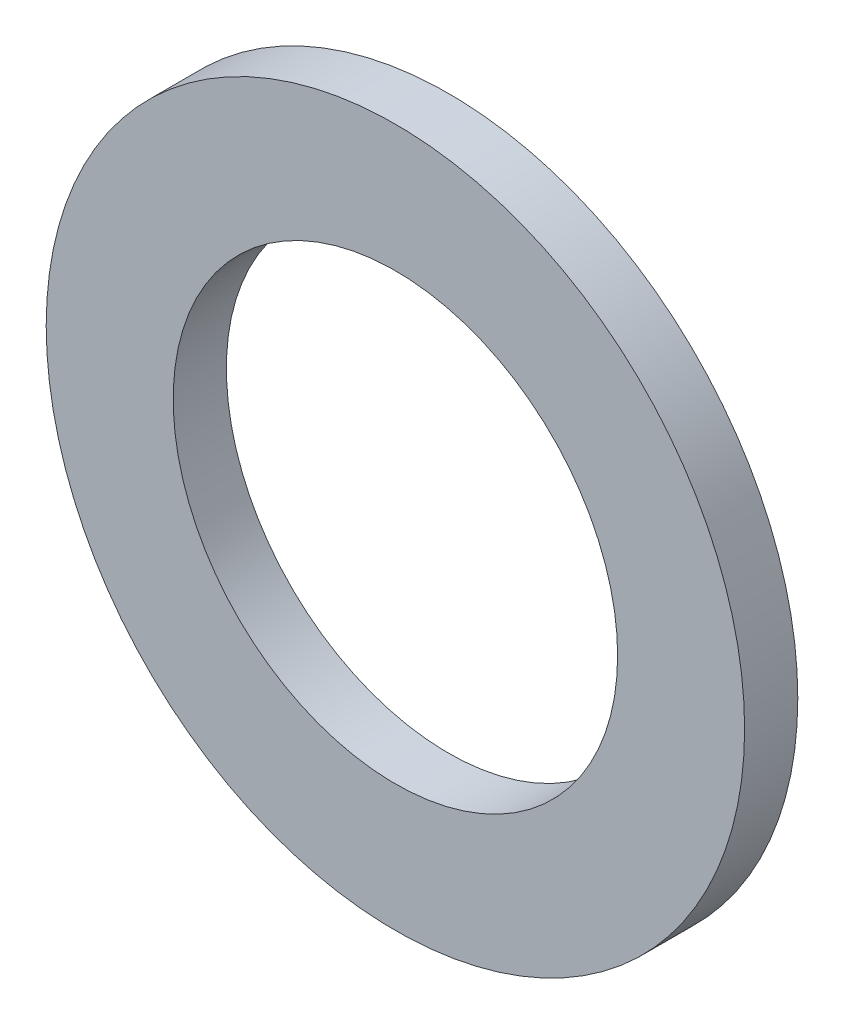
ISO-10303-21;
HEADER;
FILE_DESCRIPTION(('STEP AP214'),'2;1');
FILE_NAME('part.step','',(''),(''),'','','');
FILE_SCHEMA(('AUTOMOTIVE_DESIGN { 1 0 10303 214 1 1 1 1 }'));
ENDSEC;
DATA;
#1=APPLICATION_CONTEXT('core data for automotive mechanical design processes');
#2=APPLICATION_PROTOCOL_DEFINITION('international standard','automotive_design',2000,#1);
#3=PRODUCT_CONTEXT('',#1,'mechanical');
#4=PRODUCT('Part','Part','',(#3));
#5=PRODUCT_RELATED_PRODUCT_CATEGORY('part','',(#4));
#6=PRODUCT_DEFINITION_FORMATION('','',#4);
#7=PRODUCT_DEFINITION_CONTEXT('part definition',#1,'design');
#8=PRODUCT_DEFINITION('design','',#6,#7);
#9=PRODUCT_DEFINITION_SHAPE('','',#8);
#10=(LENGTH_UNIT() NAMED_UNIT(*) SI_UNIT(.MILLI.,.METRE.));
#11=(NAMED_UNIT(*) PLANE_ANGLE_UNIT() SI_UNIT($,.RADIAN.));
#12=(NAMED_UNIT(*) SI_UNIT($,.STERADIAN.) SOLID_ANGLE_UNIT());
#13=UNCERTAINTY_MEASURE_WITH_UNIT(LENGTH_MEASURE(1.E-05),#10,'distance_accuracy_value','');
#14=(GEOMETRIC_REPRESENTATION_CONTEXT(3) GLOBAL_UNCERTAINTY_ASSIGNED_CONTEXT((#13)) GLOBAL_UNIT_ASSIGNED_CONTEXT((#10,
#11,#12)) REPRESENTATION_CONTEXT('',''));
#15=CARTESIAN_POINT('',(0.,0.,0.));
#16=DIRECTION('',(0.,0.,1.));
#17=DIRECTION('',(1.,0.,0.));
#18=AXIS2_PLACEMENT_3D('',#15,#16,#17);
#19=CARTESIAN_POINT('',(0.,0.,3.35));
#20=DIRECTION('',(0.,0.,1.));
#21=DIRECTION('',(1.,0.,0.));
#22=AXIS2_PLACEMENT_3D('',#19,#20,#21);
#23=PLANE('',#22);
#24=CARTESIAN_POINT('',(0.,0.,3.35));
#25=DIRECTION('',(0.,0.,1.));
#26=DIRECTION('',(1.,0.,0.));
#27=AXIS2_PLACEMENT_3D('',#24,#25,#26);
#28=CIRCLE('',#27,22.);
#29=CARTESIAN_POINT('',(22.,0.,3.35));
#30=VERTEX_POINT('',#29);
#31=EDGE_CURVE('E11',#30,#30,#28,.T.);
#32=ORIENTED_EDGE('',*,*,#31,.T.);
#33=EDGE_LOOP('',(#32));
#34=FACE_BOUND('',#33,.T.);
#35=CARTESIAN_POINT('',(0.,0.,3.35));
#36=DIRECTION('',(0.,0.,1.));
#37=DIRECTION('',(1.,0.,0.));
#38=AXIS2_PLACEMENT_3D('',#35,#36,#37);
#39=CIRCLE('',#38,14.);
#40=CARTESIAN_POINT('',(14.,0.,3.35));
#41=VERTEX_POINT('',#40);
#42=EDGE_CURVE('E49',#41,#41,#39,.T.);
#43=ORIENTED_EDGE('',*,*,#42,.F.);
#44=EDGE_LOOP('',(#43));
#45=FACE_BOUND('',#44,.T.);
#46=ADVANCED_FACE('F38',(#34,#45),#23,.T.);
#47=CARTESIAN_POINT('',(0.,0.,0.));
#48=DIRECTION('',(0.,0.,1.));
#49=DIRECTION('',(1.,0.,0.));
#50=AXIS2_PLACEMENT_3D('',#47,#48,#49);
#51=PLANE('',#50);
#52=CARTESIAN_POINT('',(0.,0.,0.));
#53=DIRECTION('',(0.,0.,1.));
#54=DIRECTION('',(1.,0.,0.));
#55=AXIS2_PLACEMENT_3D('',#52,#53,#54);
#56=CIRCLE('',#55,22.);
#57=CARTESIAN_POINT('',(22.,0.,0.));
#58=VERTEX_POINT('',#57);
#59=EDGE_CURVE('E42',#58,#58,#56,.T.);
#60=ORIENTED_EDGE('',*,*,#59,.F.);
#61=EDGE_LOOP('',(#60));
#62=FACE_BOUND('',#61,.T.);
#63=CARTESIAN_POINT('',(0.,0.,0.));
#64=DIRECTION('',(0.,0.,1.));
#65=DIRECTION('',(1.,0.,0.));
#66=AXIS2_PLACEMENT_3D('',#63,#64,#65);
#67=CIRCLE('',#66,14.);
#68=CARTESIAN_POINT('',(14.,0.,0.));
#69=VERTEX_POINT('',#68);
#70=EDGE_CURVE('E51',#69,#69,#67,.T.);
#71=ORIENTED_EDGE('',*,*,#70,.T.);
#72=EDGE_LOOP('',(#71));
#73=FACE_BOUND('',#72,.T.);
#74=ADVANCED_FACE('F61',(#62,#73),#51,.F.);
#75=CARTESIAN_POINT('',(0.,0.,3.35));
#76=DIRECTION('',(0.,0.,-1.));
#77=DIRECTION('',(-1.,0.,0.));
#78=AXIS2_PLACEMENT_3D('',#75,#76,#77);
#79=CYLINDRICAL_SURFACE('',#78,22.);
#80=ORIENTED_EDGE('',*,*,#31,.F.);
#81=EDGE_LOOP('',(#80));
#82=FACE_BOUND('',#81,.T.);
#83=ORIENTED_EDGE('',*,*,#59,.T.);
#84=EDGE_LOOP('',(#83));
#85=FACE_BOUND('',#84,.T.);
#86=ADVANCED_FACE('F40',(#82,#85),#79,.T.);
#87=CARTESIAN_POINT('',(0.,0.,3.35));
#88=DIRECTION('',(0.,0.,-1.));
#89=DIRECTION('',(-1.,0.,0.));
#90=AXIS2_PLACEMENT_3D('',#87,#88,#89);
#91=CYLINDRICAL_SURFACE('',#90,14.);
#92=ORIENTED_EDGE('',*,*,#42,.T.);
#93=EDGE_LOOP('',(#92));
#94=FACE_BOUND('',#93,.T.);
#95=ORIENTED_EDGE('',*,*,#70,.F.);
#96=EDGE_LOOP('',(#95));
#97=FACE_BOUND('',#96,.T.);
#98=ADVANCED_FACE('F57',(#94,#97),#91,.F.);
#99=CLOSED_SHELL('',(#46,#74,#86,#98));
#100=MANIFOLD_SOLID_BREP('B2',#99);
#101=ADVANCED_BREP_SHAPE_REPRESENTATION('',(#18,#100),#14);
#102=SHAPE_DEFINITION_REPRESENTATION(#9,#101);
ENDSEC;
END-ISO-10303-21;
